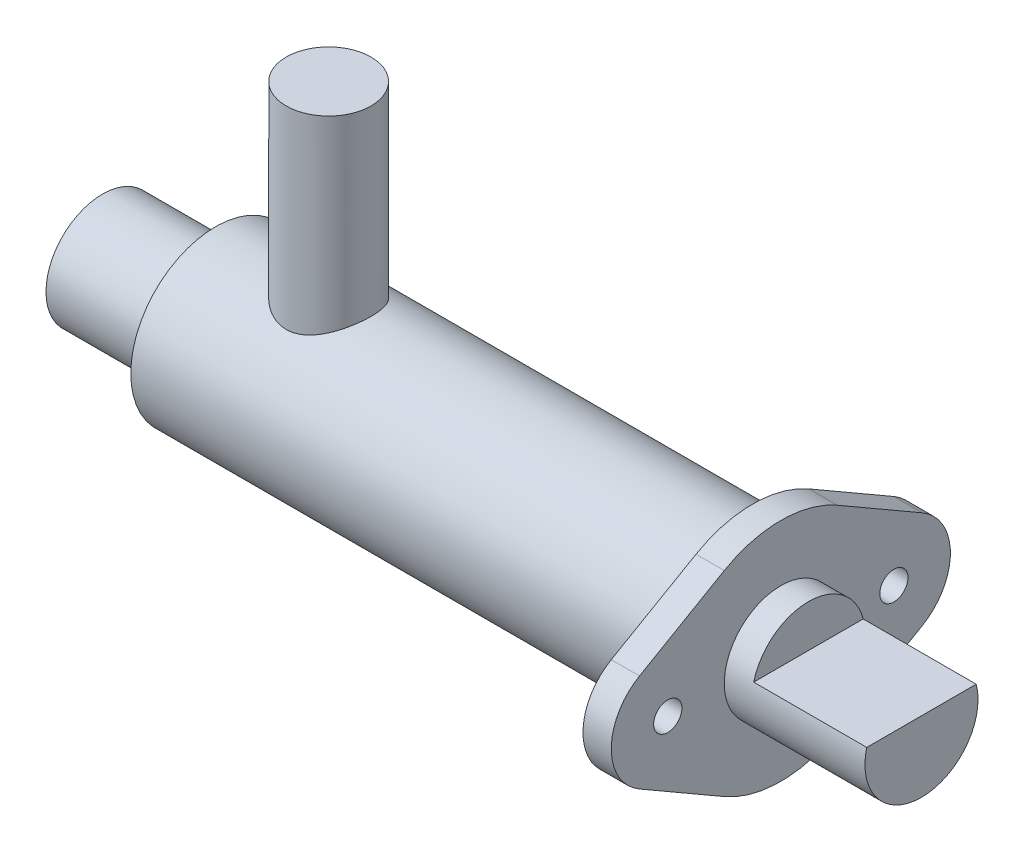
ISO-10303-21;
HEADER;
FILE_DESCRIPTION(('STEP AP214'),'2;1');
FILE_NAME('part.step','',(''),(''),'','','');
FILE_SCHEMA(('AUTOMOTIVE_DESIGN { 1 0 10303 214 1 1 1 1 }'));
ENDSEC;
DATA;
#1=APPLICATION_CONTEXT('core data for automotive mechanical design processes');
#2=APPLICATION_PROTOCOL_DEFINITION('international standard','automotive_design',2000,#1);
#3=PRODUCT_CONTEXT('',#1,'mechanical');
#4=PRODUCT('Part','Part','',(#3));
#5=PRODUCT_RELATED_PRODUCT_CATEGORY('part','',(#4));
#6=PRODUCT_DEFINITION_FORMATION('','',#4);
#7=PRODUCT_DEFINITION_CONTEXT('part definition',#1,'design');
#8=PRODUCT_DEFINITION('design','',#6,#7);
#9=PRODUCT_DEFINITION_SHAPE('','',#8);
#10=(LENGTH_UNIT() NAMED_UNIT(*) SI_UNIT(.MILLI.,.METRE.));
#11=(NAMED_UNIT(*) PLANE_ANGLE_UNIT() SI_UNIT($,.RADIAN.));
#12=(NAMED_UNIT(*) SI_UNIT($,.STERADIAN.) SOLID_ANGLE_UNIT());
#13=UNCERTAINTY_MEASURE_WITH_UNIT(LENGTH_MEASURE(1.E-05),#10,'distance_accuracy_value','');
#14=(GEOMETRIC_REPRESENTATION_CONTEXT(3) GLOBAL_UNCERTAINTY_ASSIGNED_CONTEXT((#13)) GLOBAL_UNIT_ASSIGNED_CONTEXT((#10,
#11,#12)) REPRESENTATION_CONTEXT('',''));
#15=CARTESIAN_POINT('',(0.,0.,0.));
#16=DIRECTION('',(0.,0.,1.));
#17=DIRECTION('',(1.,0.,0.));
#18=AXIS2_PLACEMENT_3D('',#15,#16,#17);
#19=CARTESIAN_POINT('',(-47.625,0.,0.));
#20=DIRECTION('',(-1.,0.,0.));
#21=DIRECTION('',(0.,0.,1.));
#22=AXIS2_PLACEMENT_3D('',#19,#20,#21);
#23=CYLINDRICAL_SURFACE('',#22,9.525);
#24=CARTESIAN_POINT('',(-34.925,0.,0.));
#25=DIRECTION('',(-1.,0.,0.));
#26=DIRECTION('',(0.,0.,1.));
#27=AXIS2_PLACEMENT_3D('',#24,#25,#26);
#28=CIRCLE('',#27,9.525);
#29=CARTESIAN_POINT('',(-34.925,0.,9.525));
#30=VERTEX_POINT('',#29);
#31=EDGE_CURVE('E54',#30,#30,#28,.T.);
#32=ORIENTED_EDGE('',*,*,#31,.F.);
#33=EDGE_LOOP('',(#32));
#34=FACE_BOUND('',#33,.T.);
#35=CARTESIAN_POINT('',(25.4,0.,0.));
#36=DIRECTION('',(-1.,0.,0.));
#37=DIRECTION('',(0.,0.,1.));
#38=AXIS2_PLACEMENT_3D('',#35,#36,#37);
#39=CIRCLE('',#38,9.525);
#40=CARTESIAN_POINT('',(25.4,0.,9.525));
#41=VERTEX_POINT('',#40);
#42=EDGE_CURVE('E11',#41,#41,#39,.F.);
#43=ORIENTED_EDGE('',*,*,#42,.F.);
#44=EDGE_LOOP('',(#43));
#45=FACE_BOUND('',#44,.T.);
#46=CARTESIAN_POINT('',(-22.225,8.24889197104678,-4.7625));
#47=CARTESIAN_POINT('',(-22.1008590969017,8.24889272394164,-4.76249940729929));
#48=CARTESIAN_POINT('',(-21.9767071497996,8.25170408952825,-4.75763943059537));
#49=CARTESIAN_POINT('',(-21.7293616546142,8.26284430339843,-4.73826449608749));
#50=CARTESIAN_POINT('',(-21.6061685797408,8.27117572034719,-4.72374504339219));
#51=CARTESIAN_POINT('',(-21.3615458554706,8.29306424044599,-4.68521103701737));
#52=CARTESIAN_POINT('',(-21.2401192826448,8.30662953786715,-4.66118159277235));
#53=CARTESIAN_POINT('',(-21.0000683650749,8.33849424083486,-4.60393332228032));
#54=CARTESIAN_POINT('',(-20.8814452632816,8.35679570478326,-4.57071050003109));
#55=CARTESIAN_POINT('',(-20.5323015748237,8.41767757563678,-4.45820926505093));
#56=CARTESIAN_POINT('',(-20.3069199645013,8.46639036631087,-4.36584227707579));
#57=CARTESIAN_POINT('',(-19.8750282380635,8.57453511094491,-4.14940045989174));
#58=CARTESIAN_POINT('',(-19.6685191436925,8.63396764474657,-4.02532391532954));
#59=CARTESIAN_POINT('',(-19.2612861365955,8.76284791263908,-3.73698658313422));
#60=CARTESIAN_POINT('',(-19.0624441753375,8.83271738343829,-3.57025552600526));
#61=CARTESIAN_POINT('',(-18.6940167283998,8.97122433178734,-3.20633353614955));
#62=CARTESIAN_POINT('',(-18.5244458361945,9.03986117960625,-3.00912750204738));
#63=CARTESIAN_POINT('',(-18.2900068266763,9.13908932048077,-2.68636629044315));
#64=CARTESIAN_POINT('',(-18.2131527226233,9.17251360649317,-2.57020878007104));
#65=CARTESIAN_POINT('',(-18.069596196185,9.23620349246427,-2.33097830003148));
#66=CARTESIAN_POINT('',(-18.0028897332615,9.26647034811662,-2.20790810968896));
#67=CARTESIAN_POINT('',(-17.8802891396933,9.32297018211123,-1.95564815668434));
#68=CARTESIAN_POINT('',(-17.8243922237504,9.34920419923749,-1.82645998115371));
#69=CARTESIAN_POINT('',(-17.7240269574238,9.39686248352726,-1.56285911383248));
#70=CARTESIAN_POINT('',(-17.6795573931323,9.41828726153724,-1.42844697872177));
#71=CARTESIAN_POINT('',(-17.6053602243203,9.45432792849539,-1.16519740858918));
#72=CARTESIAN_POINT('',(-17.5748091705922,9.46931966688269,-1.03664325296874));
#73=CARTESIAN_POINT('',(-17.5244444767481,9.49415396935545,-0.776963002287312));
#74=CARTESIAN_POINT('',(-17.5046297912202,9.50399703476961,-0.645837158923182));
#75=CARTESIAN_POINT('',(-17.4760065343755,9.51824582475992,-0.382159245593983));
#76=CARTESIAN_POINT('',(-17.4671926503398,9.52265417396123,-0.249607895282792));
#77=CARTESIAN_POINT('',(-17.4606765974385,9.52591136422363,0.0158324946519543));
#78=CARTESIAN_POINT('',(-17.4629737487424,9.52476054542327,0.148721513117988));
#79=CARTESIAN_POINT('',(-17.4779596490716,9.51727773119995,0.402105764472281));
#80=CARTESIAN_POINT('',(-17.489724135882,9.51140660802771,0.522670621045648));
#81=CARTESIAN_POINT('',(-17.52234802378,9.49520689673846,0.762297504084284));
#82=CARTESIAN_POINT('',(-17.5432102971939,9.48487690088979,0.881359043701557));
#83=CARTESIAN_POINT('',(-17.5937985131175,9.4600084221586,1.1170953858544));
#84=CARTESIAN_POINT('',(-17.6235214848597,9.44547134984976,1.23377097435057));
#85=CARTESIAN_POINT('',(-17.6915263412339,9.41253030003386,1.46405663273085));
#86=CARTESIAN_POINT('',(-17.7298115145343,9.39412483687505,1.57766550587512));
#87=CARTESIAN_POINT('',(-17.8581442489874,9.33315909327112,1.91586173980296));
#88=CARTESIAN_POINT('',(-17.961008933467,9.28518547508369,2.13476891421778));
#89=CARTESIAN_POINT('',(-18.1971915319788,9.1791264414455,2.55262754610699));
#90=CARTESIAN_POINT('',(-18.330520348699,9.12103740760329,2.75157182236461));
#91=CARTESIAN_POINT('',(-18.6383264592419,8.99371794927081,3.14406030579801));
#92=CARTESIAN_POINT('',(-18.815502061308,8.92395340854905,3.33531640619751));
#93=CARTESIAN_POINT('',(-19.1988972053729,8.78462733363278,3.68669670801986));
#94=CARTESIAN_POINT('',(-19.4051388849274,8.71506599580986,3.84679695689711));
#95=CARTESIAN_POINT('',(-19.7401135248814,8.61432292972857,4.06522723980458));
#96=CARTESIAN_POINT('',(-19.859994477451,8.58040455630013,4.13613898270465));
#97=CARTESIAN_POINT('',(-20.1061806073308,8.51583950077812,4.2674875647323));
#98=CARTESIAN_POINT('',(-20.2324828617701,8.48519134947439,4.32792911546943));
#99=CARTESIAN_POINT('',(-20.4907225092646,8.42829064611799,4.43772127646409));
#100=CARTESIAN_POINT('',(-20.6226579040663,8.40203655134898,4.48707578138171));
#101=CARTESIAN_POINT('',(-20.8912053825654,8.35498507502528,4.57409004971375));
#102=CARTESIAN_POINT('',(-21.0278145200478,8.33418432493701,4.61175703516624));
#103=CARTESIAN_POINT('',(-21.2937251064497,8.30033105740274,4.67239107161606));
#104=CARTESIAN_POINT('',(-21.4227546942039,8.28679731609861,4.69628224178035));
#105=CARTESIAN_POINT('',(-21.6827672095106,8.26567972970449,4.73335209140224));
#106=CARTESIAN_POINT('',(-21.8137490850902,8.25809279049908,4.74653634178892));
#107=CARTESIAN_POINT('',(-22.0765199908754,8.24918359612277,4.76200330923097));
#108=CARTESIAN_POINT('',(-22.208308702214,8.24785900822165,4.76429008560556));
#109=CARTESIAN_POINT('',(-22.4715269161829,8.25152581127932,4.75793657566527));
#110=CARTESIAN_POINT('',(-22.6029564424594,8.25651677591305,4.74929702692111));
#111=CARTESIAN_POINT('',(-22.8499235335336,8.27171481492305,4.72277057816311));
#112=CARTESIAN_POINT('',(-22.9656220514088,8.28128924981291,4.7060027358946));
#113=CARTESIAN_POINT('',(-23.19504203488,8.30494741203159,4.66412284465984));
#114=CARTESIAN_POINT('',(-23.3087628674355,8.3190325561764,4.63900817385685));
#115=CARTESIAN_POINT('',(-23.64585381483,8.36742301080679,4.55152408813005));
#116=CARTESIAN_POINT('',(-23.8653138630672,8.40787423037301,4.47699683650417));
#117=CARTESIAN_POINT('',(-24.2986813068859,8.50278882622772,4.29409140569222));
#118=CARTESIAN_POINT('',(-24.5118607665569,8.55781440671015,4.18430528181162));
#119=CARTESIAN_POINT('',(-24.9180392026927,8.67518529385013,3.93519108835804));
#120=CARTESIAN_POINT('',(-25.1110277360791,8.73753435328996,3.79584784304953));
#121=CARTESIAN_POINT('',(-25.4967340619561,8.87196405469708,3.4710976585416));
#122=CARTESIAN_POINT('',(-25.6863511708933,8.94428069402612,3.28209830684247));
#123=CARTESIAN_POINT('',(-26.0322210496743,9.08372577215842,2.87366994707528));
#124=CARTESIAN_POINT('',(-26.1884625493693,9.15085245356966,2.65423070130584));
#125=CARTESIAN_POINT('',(-26.3960065237566,9.24324496229829,2.30289806207733));
#126=CARTESIAN_POINT('',(-26.4613981500596,9.27299632526353,2.18030840919905));
#127=CARTESIAN_POINT('',(-26.581503084002,9.32847745043035,1.92915304044621));
#128=CARTESIAN_POINT('',(-26.6362211212174,9.35420899284426,1.80059000285164));
#129=CARTESIAN_POINT('',(-26.7343425578048,9.40087915370989,1.53844708260747));
#130=CARTESIAN_POINT('',(-26.7777513541146,9.42182005774161,1.40486962786039));
#131=CARTESIAN_POINT('',(-26.8527298949067,9.45827821966215,1.13371049467199));
#132=CARTESIAN_POINT('',(-26.8843010432804,9.47379612067972,0.99612929314372));
#133=CARTESIAN_POINT('',(-26.9328217695269,9.49775785076805,0.730949873202788));
#134=CARTESIAN_POINT('',(-26.9508474215171,9.50672024509145,0.603594424498006));
#135=CARTESIAN_POINT('',(-26.9765400141555,9.51951815365963,0.347590307680262));
#136=CARTESIAN_POINT('',(-26.9842077551466,9.52335406402124,0.218941740258937));
#137=CARTESIAN_POINT('',(-26.9890841762651,9.52579195912168,-0.0385649394422895));
#138=CARTESIAN_POINT('',(-26.9862959003281,9.52439546710759,-0.167422979823387));
#139=CARTESIAN_POINT('',(-26.9703049482656,9.51641162435963,-0.424324690613391));
#140=CARTESIAN_POINT('',(-26.9571025588401,9.50982441652587,-0.552368383343417));
#141=CARTESIAN_POINT('',(-26.921665410355,9.4922422956568,-0.798199011861471));
#142=CARTESIAN_POINT('',(-26.9000863753989,9.48156800281864,-0.916103849257608));
#143=CARTESIAN_POINT('',(-26.8482319693504,9.45610870385304,-1.14954398448085));
#144=CARTESIAN_POINT('',(-26.8179538290378,9.44132238877767,-1.26507851519124));
#145=CARTESIAN_POINT('',(-26.7145056473315,9.39128133846021,-1.60695881055025));
#146=CARTESIAN_POINT('',(-26.6286914163555,9.35032881269076,-1.82878870604021));
#147=CARTESIAN_POINT('',(-26.4220557838121,9.25477034679553,-2.26424000888416));
#148=CARTESIAN_POINT('',(-26.2998940929096,9.1996553597058,-2.47710454166772));
#149=CARTESIAN_POINT('',(-26.0256747343117,9.08152237528229,-2.88023067814637));
#150=CARTESIAN_POINT('',(-25.873603335527,9.01850075296339,-3.07048183578565));
#151=CARTESIAN_POINT('',(-25.5263886495207,8.88342722741462,-3.44287591291447));
#152=CARTESIAN_POINT('',(-25.3284649955475,8.81110081200555,-3.62232759996091));
#153=CARTESIAN_POINT('',(-24.9040995620519,8.67074486013806,-3.94652779549558));
#154=CARTESIAN_POINT('',(-24.6776328202441,8.60271916402209,-4.09124560184487));
#155=CARTESIAN_POINT('',(-24.3164807674514,8.50907579729457,-4.28094082941504));
#156=CARTESIAN_POINT('',(-24.190363422381,8.47885685291069,-4.34031088280345));
#157=CARTESIAN_POINT('',(-23.932589170762,8.42284293524443,-4.44803619028847));
#158=CARTESIAN_POINT('',(-23.8009351588988,8.39704568515324,-4.49639711741462));
#159=CARTESIAN_POINT('',(-23.5333464997363,8.35096779630417,-4.58140792637852));
#160=CARTESIAN_POINT('',(-23.3974238745861,8.33067298601897,-4.61808793582061));
#161=CARTESIAN_POINT('',(-23.1221672323918,8.29641582497272,-4.67935352294883));
#162=CARTESIAN_POINT('',(-22.982835672277,8.28244904731642,-4.70394755663098));
#163=CARTESIAN_POINT('',(-22.7403045126998,8.26434282908568,-4.73566148400959));
#164=CARTESIAN_POINT('',(-22.637599934044,8.25856285278519,-4.74571628165859));
#165=CARTESIAN_POINT('',(-22.431599478867,8.25083698225999,-4.7591360100298));
#166=CARTESIAN_POINT('',(-22.3283035632528,8.24889134452708,-4.76250049321452));
#167=CARTESIAN_POINT('',(-22.225,8.24889197104678,-4.7625));
#168=B_SPLINE_CURVE_WITH_KNOTS('',3,(#46,#47,#48,#49,#50,#51,#52,#53,#54,#55,#56,#57,#58,#59,
#60,#61,#62,#63,#64,#65,#66,#67,#68,#69,#70,#71,#72,#73,#74,#75,#76,#77,#78,#79,#80,#81,#82,#83,
#84,#85,#86,#87,#88,#89,#90,#91,#92,#93,#94,#95,#96,#97,#98,#99,#100,#101,#102,#103,#104,#105,
#106,#107,#108,#109,#110,#111,#112,#113,#114,#115,#116,#117,#118,#119,#120,#121,#122,#123,#124,
#125,#126,#127,#128,#129,#130,#131,#132,#133,#134,#135,#136,#137,#138,#139,#140,#141,#142,#143,
#144,#145,#146,#147,#148,#149,#150,#151,#152,#153,#154,#155,#156,#157,#158,#159,#160,#161,#162,
#163,#164,#165,#166,#167),.UNSPECIFIED.,.T.,.F.,(4,2,2,2,2,2,2,2,2,2,2,2,2,2,2,2,2,2,2,2,2,2,2,
2,2,2,2,2,2,2,2,2,2,2,2,2,2,2,2,2,2,2,2,2,2,2,2,2,2,2,2,2,2,2,2,2,2,2,2,2,4),(0.,
0.372315471290056,0.74480431525927,1.11787871748515,1.49111553598561,2.23280682202776,
2.97453823893684,3.77744614727716,4.58075320689749,5.00998800301853,5.43905143864814,
5.8680041696826,6.29691131496348,6.69531812541003,7.09368613557448,7.4918616836556,
7.89001286961349,8.25342137640537,8.61694470062129,8.98034628149852,9.3438876822603,
10.0802760151874,10.8169283051732,11.6232144167404,12.4301179713144,12.8597106878863,
13.289109581744,13.7183573995584,14.1473394427285,14.5425345752374,14.9375239513557,
15.3323661820562,15.7271817607473,16.0786628916725,16.4302545314545,17.1329551681528,
17.8682015372252,18.603826327115,19.432180208912,20.2608133654722,20.6865967300835,
21.1121909950173,21.5375817864788,21.9629221125511,22.3492223853007,22.735492807399,
23.1216507879208,23.5077981379075,23.8683853074205,24.2290873914766,24.9498683654814,
25.7014774099866,26.4534323155185,27.2802219250812,28.1077396849722,28.5351353836894,
28.9623103432981,29.388374431565,29.8141399966485,30.1239407256422,30.4337621775449),.UNSPECIFIED.);
#169=CARTESIAN_POINT('',(-22.225,8.24889197104678,-4.7625));
#170=VERTEX_POINT('',#169);
#171=EDGE_CURVE('E45',#170,#170,#168,.T.);
#172=ORIENTED_EDGE('',*,*,#171,.T.);
#173=EDGE_LOOP('',(#172));
#174=FACE_BOUND('',#173,.T.);
#175=ADVANCED_FACE('F41',(#34,#45,#174),#23,.T.);
#176=CARTESIAN_POINT('',(-34.925,-6.35,0.));
#177=DIRECTION('',(-1.,0.,0.));
#178=DIRECTION('',(0.,0.,1.));
#179=AXIS2_PLACEMENT_3D('',#176,#177,#178);
#180=PLANE('',#179);
#181=ORIENTED_EDGE('',*,*,#31,.T.);
#182=EDGE_LOOP('',(#181));
#183=FACE_BOUND('',#182,.T.);
#184=CARTESIAN_POINT('',(-34.925,0.,0.));
#185=DIRECTION('',(-1.,0.,0.));
#186=DIRECTION('',(0.,0.,1.));
#187=AXIS2_PLACEMENT_3D('',#184,#185,#186);
#188=CIRCLE('',#187,6.35);
#189=CARTESIAN_POINT('',(-34.925,0.,6.35));
#190=VERTEX_POINT('',#189);
#191=EDGE_CURVE('E201',#190,#190,#188,.T.);
#192=ORIENTED_EDGE('',*,*,#191,.F.);
#193=EDGE_LOOP('',(#192));
#194=FACE_BOUND('',#193,.T.);
#195=ADVANCED_FACE('F207',(#183,#194),#180,.T.);
#196=CARTESIAN_POINT('',(-47.625,0.,0.));
#197=DIRECTION('',(-1.,0.,0.));
#198=DIRECTION('',(0.,0.,1.));
#199=AXIS2_PLACEMENT_3D('',#196,#197,#198);
#200=CYLINDRICAL_SURFACE('',#199,6.35);
#201=ORIENTED_EDGE('',*,*,#191,.T.);
#202=EDGE_LOOP('',(#201));
#203=FACE_BOUND('',#202,.T.);
#204=CARTESIAN_POINT('',(-47.625,0.,0.));
#205=DIRECTION('',(-1.,0.,0.));
#206=DIRECTION('',(0.,0.,1.));
#207=AXIS2_PLACEMENT_3D('',#204,#205,#206);
#208=CIRCLE('',#207,6.35);
#209=CARTESIAN_POINT('',(-47.625,0.,6.35));
#210=VERTEX_POINT('',#209);
#211=EDGE_CURVE('E198',#210,#210,#208,.T.);
#212=ORIENTED_EDGE('',*,*,#211,.F.);
#213=EDGE_LOOP('',(#212));
#214=FACE_BOUND('',#213,.T.);
#215=ADVANCED_FACE('F299',(#203,#214),#200,.T.);
#216=CARTESIAN_POINT('',(-47.625,0.,0.));
#217=DIRECTION('',(-1.,0.,0.));
#218=DIRECTION('',(0.,0.,1.));
#219=AXIS2_PLACEMENT_3D('',#216,#217,#218);
#220=PLANE('',#219);
#221=ORIENTED_EDGE('',*,*,#211,.T.);
#222=EDGE_LOOP('',(#221));
#223=FACE_BOUND('',#222,.T.);
#224=ADVANCED_FACE('F296',(#223),#220,.T.);
#225=CARTESIAN_POINT('',(25.4,0.,12.7));
#226=DIRECTION('',(1.,0.,0.));
#227=DIRECTION('',(0.,0.,-1.));
#228=AXIS2_PLACEMENT_3D('',#225,#226,#227);
#229=CYLINDRICAL_SURFACE('',#228,6.34999999999997);
#230=CARTESIAN_POINT('',(28.575,0.,12.7));
#231=DIRECTION('',(-1.,0.,0.));
#232=DIRECTION('',(0.,0.,1.));
#233=AXIS2_PLACEMENT_3D('',#230,#231,#232);
#234=CIRCLE('',#233,6.34999999999997);
#235=CARTESIAN_POINT('',(28.575,-5.4992613140312,15.875));
#236=VERTEX_POINT('',#235);
#237=CARTESIAN_POINT('',(28.575,5.49926131403114,15.875));
#238=VERTEX_POINT('',#237);
#239=EDGE_CURVE('E162',#236,#238,#234,.T.);
#240=ORIENTED_EDGE('',*,*,#239,.T.);
#241=DIRECTION('',(1.,0.,0.));
#242=VECTOR('',#241,1.);
#243=CARTESIAN_POINT('',(25.4,5.49926131403114,15.875));
#244=LINE('',#243,#242);
#245=CARTESIAN_POINT('',(25.4,5.49926131403114,15.875));
#246=VERTEX_POINT('',#245);
#247=EDGE_CURVE('E196',#246,#238,#244,.T.);
#248=ORIENTED_EDGE('',*,*,#247,.F.);
#249=CARTESIAN_POINT('',(25.4,0.,12.7));
#250=DIRECTION('',(-1.,0.,0.));
#251=DIRECTION('',(0.,0.,1.));
#252=AXIS2_PLACEMENT_3D('',#249,#250,#251);
#253=CIRCLE('',#252,6.34999999999997);
#254=CARTESIAN_POINT('',(25.4,-5.4992613140312,15.875));
#255=VERTEX_POINT('',#254);
#256=EDGE_CURVE('E186',#255,#246,#253,.T.);
#257=ORIENTED_EDGE('',*,*,#256,.F.);
#258=DIRECTION('',(1.,0.,0.));
#259=VECTOR('',#258,1.);
#260=CARTESIAN_POINT('',(25.4,-5.4992613140312,15.875));
#261=LINE('',#260,#259);
#262=EDGE_CURVE('E70',#255,#236,#261,.T.);
#263=ORIENTED_EDGE('',*,*,#262,.T.);
#264=EDGE_LOOP('',(#240,#248,#257,#263));
#265=FACE_BOUND('',#264,.T.);
#266=ADVANCED_FACE('F273',(#265),#229,.T.);
#267=CARTESIAN_POINT('',(25.4,5.49926131403114,15.875));
#268=DIRECTION('',(0.,-0.866025403784437,-0.500000000000003));
#269=DIRECTION('',(0.,0.500000000000003,-0.866025403784437));
#270=AXIS2_PLACEMENT_3D('',#267,#268,#269);
#271=PLANE('',#270);
#272=DIRECTION('',(0.,0.500000000000003,-0.866025403784437));
#273=VECTOR('',#272,1.);
#274=CARTESIAN_POINT('',(28.575,5.49926131403114,15.875));
#275=LINE('',#274,#273);
#276=CARTESIAN_POINT('',(28.575,10.9985226280624,6.35000000000004));
#277=VERTEX_POINT('',#276);
#278=EDGE_CURVE('E164',#238,#277,#275,.T.);
#279=ORIENTED_EDGE('',*,*,#278,.T.);
#280=DIRECTION('',(1.,0.,0.));
#281=VECTOR('',#280,1.);
#282=CARTESIAN_POINT('',(25.4,10.9985226280624,6.35000000000004));
#283=LINE('',#282,#281);
#284=CARTESIAN_POINT('',(25.4,10.9985226280624,6.35000000000004));
#285=VERTEX_POINT('',#284);
#286=EDGE_CURVE('E194',#285,#277,#283,.T.);
#287=ORIENTED_EDGE('',*,*,#286,.F.);
#288=DIRECTION('',(0.,0.500000000000003,-0.866025403784437));
#289=VECTOR('',#288,1.);
#290=CARTESIAN_POINT('',(25.4,5.49926131403114,15.875));
#291=LINE('',#290,#289);
#292=EDGE_CURVE('E110',#246,#285,#291,.T.);
#293=ORIENTED_EDGE('',*,*,#292,.F.);
#294=ORIENTED_EDGE('',*,*,#247,.T.);
#295=EDGE_LOOP('',(#279,#287,#293,#294));
#296=FACE_BOUND('',#295,.T.);
#297=ADVANCED_FACE('F274',(#296),#271,.F.);
#298=CARTESIAN_POINT('',(25.4,0.,0.));
#299=DIRECTION('',(1.,0.,0.));
#300=DIRECTION('',(0.,0.,-1.));
#301=AXIS2_PLACEMENT_3D('',#298,#299,#300);
#302=CYLINDRICAL_SURFACE('',#301,12.7000000000001);
#303=CARTESIAN_POINT('',(28.575,0.,0.));
#304=DIRECTION('',(1.,0.,0.));
#305=DIRECTION('',(0.,0.,-1.));
#306=AXIS2_PLACEMENT_3D('',#303,#304,#305);
#307=CIRCLE('',#306,12.7000000000001);
#308=CARTESIAN_POINT('',(28.575,10.9985226280623,-6.35000000000016));
#309=VERTEX_POINT('',#308);
#310=EDGE_CURVE('E169',#309,#277,#307,.T.);
#311=ORIENTED_EDGE('',*,*,#310,.F.);
#312=DIRECTION('',(1.,0.,0.));
#313=VECTOR('',#312,1.);
#314=CARTESIAN_POINT('',(25.4,10.9985226280623,-6.35000000000016));
#315=LINE('',#314,#313);
#316=CARTESIAN_POINT('',(25.4,10.9985226280623,-6.35000000000016));
#317=VERTEX_POINT('',#316);
#318=EDGE_CURVE('E192',#317,#309,#315,.T.);
#319=ORIENTED_EDGE('',*,*,#318,.F.);
#320=CARTESIAN_POINT('',(25.4,0.,0.));
#321=DIRECTION('',(1.,0.,0.));
#322=DIRECTION('',(0.,0.,-1.));
#323=AXIS2_PLACEMENT_3D('',#320,#321,#322);
#324=CIRCLE('',#323,12.7000000000001);
#325=EDGE_CURVE('E259',#317,#285,#324,.T.);
#326=ORIENTED_EDGE('',*,*,#325,.T.);
#327=ORIENTED_EDGE('',*,*,#286,.T.);
#328=EDGE_LOOP('',(#311,#319,#326,#327));
#329=FACE_BOUND('',#328,.T.);
#330=ADVANCED_FACE('F277',(#329),#302,.T.);
#331=CARTESIAN_POINT('',(25.4,5.4992613140312,-15.8750000000002));
#332=DIRECTION('',(0.,0.866025403784439,-0.5));
#333=DIRECTION('',(0.,0.5,0.866025403784439));
#334=AXIS2_PLACEMENT_3D('',#331,#332,#333);
#335=PLANE('',#334);
#336=DIRECTION('',(0.,0.5,0.866025403784439));
#337=VECTOR('',#336,1.);
#338=CARTESIAN_POINT('',(28.575,5.4992613140312,-15.8750000000002));
#339=LINE('',#338,#337);
#340=CARTESIAN_POINT('',(28.575,5.4992613140312,-15.8750000000002));
#341=VERTEX_POINT('',#340);
#342=EDGE_CURVE('E173',#341,#309,#339,.T.);
#343=ORIENTED_EDGE('',*,*,#342,.F.);
#344=DIRECTION('',(1.,0.,0.));
#345=VECTOR('',#344,1.);
#346=CARTESIAN_POINT('',(25.4,5.4992613140312,-15.8750000000002));
#347=LINE('',#346,#345);
#348=CARTESIAN_POINT('',(25.4,5.4992613140312,-15.8750000000002));
#349=VERTEX_POINT('',#348);
#350=EDGE_CURVE('E190',#349,#341,#347,.T.);
#351=ORIENTED_EDGE('',*,*,#350,.F.);
#352=DIRECTION('',(0.,0.5,0.866025403784439));
#353=VECTOR('',#352,1.);
#354=CARTESIAN_POINT('',(25.4,5.4992613140312,-15.8750000000002));
#355=LINE('',#354,#353);
#356=EDGE_CURVE('E263',#349,#317,#355,.T.);
#357=ORIENTED_EDGE('',*,*,#356,.T.);
#358=ORIENTED_EDGE('',*,*,#318,.T.);
#359=EDGE_LOOP('',(#343,#351,#357,#358));
#360=FACE_BOUND('',#359,.T.);
#361=ADVANCED_FACE('F279',(#360),#335,.T.);
#362=CARTESIAN_POINT('',(25.4,0.,-12.7000000000002));
#363=DIRECTION('',(1.,0.,0.));
#364=DIRECTION('',(0.,0.,-1.));
#365=AXIS2_PLACEMENT_3D('',#362,#363,#364);
#366=CYLINDRICAL_SURFACE('',#365,6.34999999999999);
#367=CARTESIAN_POINT('',(28.575,0.,-12.7000000000002));
#368=DIRECTION('',(1.,0.,0.));
#369=DIRECTION('',(0.,0.,-1.));
#370=AXIS2_PLACEMENT_3D('',#367,#368,#369);
#371=CIRCLE('',#370,6.34999999999999);
#372=CARTESIAN_POINT('',(28.575,-5.49926131403115,-15.8750000000002));
#373=VERTEX_POINT('',#372);
#374=EDGE_CURVE('E176',#373,#341,#371,.T.);
#375=ORIENTED_EDGE('',*,*,#374,.F.);
#376=DIRECTION('',(1.,0.,0.));
#377=VECTOR('',#376,1.);
#378=CARTESIAN_POINT('',(25.4,-5.49926131403115,-15.8750000000002));
#379=LINE('',#378,#377);
#380=CARTESIAN_POINT('',(25.4,-5.49926131403115,-15.8750000000002));
#381=VERTEX_POINT('',#380);
#382=EDGE_CURVE('E149',#381,#373,#379,.T.);
#383=ORIENTED_EDGE('',*,*,#382,.F.);
#384=CARTESIAN_POINT('',(25.4,0.,-12.7000000000002));
#385=DIRECTION('',(1.,0.,0.));
#386=DIRECTION('',(0.,0.,-1.));
#387=AXIS2_PLACEMENT_3D('',#384,#385,#386);
#388=CIRCLE('',#387,6.34999999999999);
#389=EDGE_CURVE('E138',#381,#349,#388,.T.);
#390=ORIENTED_EDGE('',*,*,#389,.T.);
#391=ORIENTED_EDGE('',*,*,#350,.T.);
#392=EDGE_LOOP('',(#375,#383,#390,#391));
#393=FACE_BOUND('',#392,.T.);
#394=ADVANCED_FACE('F267',(#393),#366,.T.);
#395=CARTESIAN_POINT('',(25.4,-5.49926131403115,-15.8750000000002));
#396=DIRECTION('',(0.,0.866025403784437,0.500000000000002));
#397=DIRECTION('',(0.,-0.500000000000002,0.866025403784437));
#398=AXIS2_PLACEMENT_3D('',#395,#396,#397);
#399=PLANE('',#398);
#400=DIRECTION('',(0.,-0.500000000000002,0.866025403784437));
#401=VECTOR('',#400,1.);
#402=CARTESIAN_POINT('',(28.575,-5.49926131403115,-15.8750000000002));
#403=LINE('',#402,#401);
#404=CARTESIAN_POINT('',(28.575,-10.9985226280623,-6.35000000000022));
#405=VERTEX_POINT('',#404);
#406=EDGE_CURVE('E145',#373,#405,#403,.T.);
#407=ORIENTED_EDGE('',*,*,#406,.T.);
#408=DIRECTION('',(1.,0.,0.));
#409=VECTOR('',#408,1.);
#410=CARTESIAN_POINT('',(25.4,-10.9985226280623,-6.35000000000022));
#411=LINE('',#410,#409);
#412=CARTESIAN_POINT('',(25.4,-10.9985226280623,-6.35000000000022));
#413=VERTEX_POINT('',#412);
#414=EDGE_CURVE('E142',#413,#405,#411,.T.);
#415=ORIENTED_EDGE('',*,*,#414,.F.);
#416=DIRECTION('',(0.,-0.500000000000002,0.866025403784437));
#417=VECTOR('',#416,1.);
#418=CARTESIAN_POINT('',(25.4,-5.49926131403115,-15.8750000000002));
#419=LINE('',#418,#417);
#420=EDGE_CURVE('E130',#381,#413,#419,.T.);
#421=ORIENTED_EDGE('',*,*,#420,.F.);
#422=ORIENTED_EDGE('',*,*,#382,.T.);
#423=EDGE_LOOP('',(#407,#415,#421,#422));
#424=FACE_BOUND('',#423,.T.);
#425=ADVANCED_FACE('F143',(#424),#399,.F.);
#426=CARTESIAN_POINT('',(25.4,0.,0.));
#427=DIRECTION('',(1.,0.,0.));
#428=DIRECTION('',(0.,0.,-1.));
#429=AXIS2_PLACEMENT_3D('',#426,#427,#428);
#430=CYLINDRICAL_SURFACE('',#429,12.7);
#431=CARTESIAN_POINT('',(28.575,0.,0.));
#432=DIRECTION('',(1.,0.,0.));
#433=DIRECTION('',(0.,0.,-1.));
#434=AXIS2_PLACEMENT_3D('',#431,#432,#433);
#435=CIRCLE('',#434,12.7);
#436=CARTESIAN_POINT('',(28.575,-10.9985226280624,6.35000000000003));
#437=VERTEX_POINT('',#436);
#438=EDGE_CURVE('E180',#437,#405,#435,.T.);
#439=ORIENTED_EDGE('',*,*,#438,.F.);
#440=DIRECTION('',(1.,0.,0.));
#441=VECTOR('',#440,1.);
#442=CARTESIAN_POINT('',(25.4,-10.9985226280624,6.35000000000003));
#443=LINE('',#442,#441);
#444=CARTESIAN_POINT('',(25.4,-10.9985226280624,6.35000000000003));
#445=VERTEX_POINT('',#444);
#446=EDGE_CURVE('E150',#445,#437,#443,.T.);
#447=ORIENTED_EDGE('',*,*,#446,.F.);
#448=CARTESIAN_POINT('',(25.4,0.,0.));
#449=DIRECTION('',(1.,0.,0.));
#450=DIRECTION('',(0.,0.,-1.));
#451=AXIS2_PLACEMENT_3D('',#448,#449,#450);
#452=CIRCLE('',#451,12.7);
#453=EDGE_CURVE('E135',#445,#413,#452,.T.);
#454=ORIENTED_EDGE('',*,*,#453,.T.);
#455=ORIENTED_EDGE('',*,*,#414,.T.);
#456=EDGE_LOOP('',(#439,#447,#454,#455));
#457=FACE_BOUND('',#456,.T.);
#458=ADVANCED_FACE('F152',(#457),#430,.T.);
#459=CARTESIAN_POINT('',(25.4,-5.4992613140312,15.875));
#460=DIRECTION('',(0.,-0.866025403784438,0.500000000000001));
#461=DIRECTION('',(0.,-0.500000000000001,-0.866025403784438));
#462=AXIS2_PLACEMENT_3D('',#459,#460,#461);
#463=PLANE('',#462);
#464=DIRECTION('',(0.,-0.500000000000001,-0.866025403784438));
#465=VECTOR('',#464,1.);
#466=CARTESIAN_POINT('',(28.575,-5.4992613140312,15.875));
#467=LINE('',#466,#465);
#468=EDGE_CURVE('E183',#236,#437,#467,.T.);
#469=ORIENTED_EDGE('',*,*,#468,.F.);
#470=ORIENTED_EDGE('',*,*,#262,.F.);
#471=DIRECTION('',(0.,-0.500000000000001,-0.866025403784438));
#472=VECTOR('',#471,1.);
#473=CARTESIAN_POINT('',(25.4,-5.4992613140312,15.875));
#474=LINE('',#473,#472);
#475=EDGE_CURVE('E154',#255,#445,#474,.T.);
#476=ORIENTED_EDGE('',*,*,#475,.T.);
#477=ORIENTED_EDGE('',*,*,#446,.T.);
#478=EDGE_LOOP('',(#469,#470,#476,#477));
#479=FACE_BOUND('',#478,.T.);
#480=ADVANCED_FACE('F270',(#479),#463,.T.);
#481=CARTESIAN_POINT('',(25.4,0.,12.7));
#482=DIRECTION('',(-1.,0.,0.));
#483=DIRECTION('',(0.,0.,1.));
#484=AXIS2_PLACEMENT_3D('',#481,#482,#483);
#485=PLANE('',#484);
#486=ORIENTED_EDGE('',*,*,#42,.T.);
#487=EDGE_LOOP('',(#486));
#488=FACE_BOUND('',#487,.T.);
#489=CARTESIAN_POINT('',(25.4,0.,-12.7000000000002));
#490=DIRECTION('',(1.,0.,0.));
#491=DIRECTION('',(0.,0.,-1.));
#492=AXIS2_PLACEMENT_3D('',#489,#490,#491);
#493=CIRCLE('',#492,1.5875);
#494=CARTESIAN_POINT('',(25.4,0.,-14.2875000000002));
#495=VERTEX_POINT('',#494);
#496=EDGE_CURVE('E242',#495,#495,#493,.T.);
#497=ORIENTED_EDGE('',*,*,#496,.T.);
#498=EDGE_LOOP('',(#497));
#499=FACE_BOUND('',#498,.T.);
#500=CARTESIAN_POINT('',(25.4,0.,12.7));
#501=DIRECTION('',(1.,0.,0.));
#502=DIRECTION('',(0.,0.,-1.));
#503=AXIS2_PLACEMENT_3D('',#500,#501,#502);
#504=CIRCLE('',#503,1.5875);
#505=CARTESIAN_POINT('',(25.4,0.,11.1125));
#506=VERTEX_POINT('',#505);
#507=EDGE_CURVE('E165',#506,#506,#504,.T.);
#508=ORIENTED_EDGE('',*,*,#507,.T.);
#509=EDGE_LOOP('',(#508));
#510=FACE_BOUND('',#509,.T.);
#511=ORIENTED_EDGE('',*,*,#256,.T.);
#512=ORIENTED_EDGE('',*,*,#292,.T.);
#513=ORIENTED_EDGE('',*,*,#325,.F.);
#514=ORIENTED_EDGE('',*,*,#356,.F.);
#515=ORIENTED_EDGE('',*,*,#389,.F.);
#516=ORIENTED_EDGE('',*,*,#420,.T.);
#517=ORIENTED_EDGE('',*,*,#453,.F.);
#518=ORIENTED_EDGE('',*,*,#475,.F.);
#519=EDGE_LOOP('',(#511,#512,#513,#514,#515,#516,#517,#518));
#520=FACE_BOUND('',#519,.T.);
#521=ADVANCED_FACE('F132',(#488,#499,#510,#520),#485,.T.);
#522=CARTESIAN_POINT('',(25.4,0.,12.7));
#523=DIRECTION('',(1.,0.,0.));
#524=DIRECTION('',(0.,0.,-1.));
#525=AXIS2_PLACEMENT_3D('',#522,#523,#524);
#526=CYLINDRICAL_SURFACE('',#525,1.5875);
#527=ORIENTED_EDGE('',*,*,#507,.F.);
#528=EDGE_LOOP('',(#527));
#529=FACE_BOUND('',#528,.T.);
#530=CARTESIAN_POINT('',(28.575,0.,12.7));
#531=DIRECTION('',(1.,0.,0.));
#532=DIRECTION('',(0.,0.,-1.));
#533=AXIS2_PLACEMENT_3D('',#530,#531,#532);
#534=CIRCLE('',#533,1.5875);
#535=CARTESIAN_POINT('',(28.575,0.,11.1125));
#536=VERTEX_POINT('',#535);
#537=EDGE_CURVE('E246',#536,#536,#534,.T.);
#538=ORIENTED_EDGE('',*,*,#537,.T.);
#539=EDGE_LOOP('',(#538));
#540=FACE_BOUND('',#539,.T.);
#541=ADVANCED_FACE('F378',(#529,#540),#526,.F.);
#542=CARTESIAN_POINT('',(25.4,0.,-12.7000000000002));
#543=DIRECTION('',(1.,0.,0.));
#544=DIRECTION('',(0.,0.,-1.));
#545=AXIS2_PLACEMENT_3D('',#542,#543,#544);
#546=CYLINDRICAL_SURFACE('',#545,1.5875);
#547=ORIENTED_EDGE('',*,*,#496,.F.);
#548=EDGE_LOOP('',(#547));
#549=FACE_BOUND('',#548,.T.);
#550=CARTESIAN_POINT('',(28.575,0.,-12.7000000000002));
#551=DIRECTION('',(1.,0.,0.));
#552=DIRECTION('',(0.,0.,-1.));
#553=AXIS2_PLACEMENT_3D('',#550,#551,#552);
#554=CIRCLE('',#553,1.5875);
#555=CARTESIAN_POINT('',(28.575,0.,-14.2875000000002));
#556=VERTEX_POINT('',#555);
#557=EDGE_CURVE('E241',#556,#556,#554,.T.);
#558=ORIENTED_EDGE('',*,*,#557,.T.);
#559=EDGE_LOOP('',(#558));
#560=FACE_BOUND('',#559,.T.);
#561=ADVANCED_FACE('F315',(#549,#560),#546,.F.);
#562=CARTESIAN_POINT('',(28.575,0.,0.));
#563=DIRECTION('',(-1.,0.,0.));
#564=DIRECTION('',(0.,0.,1.));
#565=AXIS2_PLACEMENT_3D('',#562,#563,#564);
#566=PLANE('',#565);
#567=CARTESIAN_POINT('',(28.575,0.,0.));
#568=DIRECTION('',(1.,0.,0.));
#569=DIRECTION('',(0.,0.,-1.));
#570=AXIS2_PLACEMENT_3D('',#567,#568,#569);
#571=CIRCLE('',#570,6.35);
#572=CARTESIAN_POINT('',(28.575,0.,-6.35));
#573=VERTEX_POINT('',#572);
#574=EDGE_CURVE('E238',#573,#573,#571,.T.);
#575=ORIENTED_EDGE('',*,*,#574,.F.);
#576=EDGE_LOOP('',(#575));
#577=FACE_BOUND('',#576,.T.);
#578=ORIENTED_EDGE('',*,*,#557,.F.);
#579=EDGE_LOOP('',(#578));
#580=FACE_BOUND('',#579,.T.);
#581=ORIENTED_EDGE('',*,*,#537,.F.);
#582=EDGE_LOOP('',(#581));
#583=FACE_BOUND('',#582,.T.);
#584=ORIENTED_EDGE('',*,*,#239,.F.);
#585=ORIENTED_EDGE('',*,*,#468,.T.);
#586=ORIENTED_EDGE('',*,*,#438,.T.);
#587=ORIENTED_EDGE('',*,*,#406,.F.);
#588=ORIENTED_EDGE('',*,*,#374,.T.);
#589=ORIENTED_EDGE('',*,*,#342,.T.);
#590=ORIENTED_EDGE('',*,*,#310,.T.);
#591=ORIENTED_EDGE('',*,*,#278,.F.);
#592=EDGE_LOOP('',(#584,#585,#586,#587,#588,#589,#590,#591));
#593=FACE_BOUND('',#592,.T.);
#594=ADVANCED_FACE('F43',(#577,#580,#583,#593),#566,.F.);
#595=CARTESIAN_POINT('',(44.3761161124671,0.,0.));
#596=DIRECTION('',(-1.,0.,0.));
#597=DIRECTION('',(0.,-1.,0.));
#598=AXIS2_PLACEMENT_3D('',#595,#596,#597);
#599=CYLINDRICAL_SURFACE('',#598,6.35);
#600=CARTESIAN_POINT('',(44.3761161124671,0.,0.));
#601=DIRECTION('',(1.,0.,0.));
#602=DIRECTION('',(0.,1.,0.));
#603=AXIS2_PLACEMENT_3D('',#600,#601,#602);
#604=CIRCLE('',#603,6.35);
#605=CARTESIAN_POINT('',(44.3761161124671,1.5875,6.14836106210428));
#606=VERTEX_POINT('',#605);
#607=CARTESIAN_POINT('',(44.3761161124671,1.5875,-6.14836106210428));
#608=VERTEX_POINT('',#607);
#609=EDGE_CURVE('E234',#606,#608,#604,.T.);
#610=ORIENTED_EDGE('',*,*,#609,.F.);
#611=DIRECTION('',(1.,0.,0.));
#612=VECTOR('',#611,1.);
#613=CARTESIAN_POINT('',(31.6761161124671,1.5875,6.14836106210428));
#614=LINE('',#613,#612);
#615=CARTESIAN_POINT('',(31.6761161124671,1.5875,6.14836106210428));
#616=VERTEX_POINT('',#615);
#617=EDGE_CURVE('E61',#616,#606,#614,.T.);
#618=ORIENTED_EDGE('',*,*,#617,.F.);
#619=CARTESIAN_POINT('',(31.6761161124671,0.,0.));
#620=DIRECTION('',(1.,0.,0.));
#621=DIRECTION('',(0.,1.,0.));
#622=AXIS2_PLACEMENT_3D('',#619,#620,#621);
#623=CIRCLE('',#622,6.35);
#624=CARTESIAN_POINT('',(31.6761161124671,1.5875,-6.14836106210428));
#625=VERTEX_POINT('',#624);
#626=EDGE_CURVE('E219',#625,#616,#623,.T.);
#627=ORIENTED_EDGE('',*,*,#626,.F.);
#628=DIRECTION('',(1.,0.,0.));
#629=VECTOR('',#628,1.);
#630=CARTESIAN_POINT('',(31.6761161124671,1.5875,-6.14836106210428));
#631=LINE('',#630,#629);
#632=EDGE_CURVE('E231',#625,#608,#631,.T.);
#633=ORIENTED_EDGE('',*,*,#632,.T.);
#634=EDGE_LOOP('',(#610,#618,#627,#633));
#635=FACE_BOUND('',#634,.T.);
#636=ORIENTED_EDGE('',*,*,#574,.T.);
#637=EDGE_LOOP('',(#636));
#638=FACE_BOUND('',#637,.T.);
#639=ADVANCED_FACE('F314',(#635,#638),#599,.T.);
#640=CARTESIAN_POINT('',(44.3761161124671,0.,0.));
#641=DIRECTION('',(1.,0.,0.));
#642=DIRECTION('',(0.,1.,0.));
#643=AXIS2_PLACEMENT_3D('',#640,#641,#642);
#644=PLANE('',#643);
#645=DIRECTION('',(0.,0.,-1.));
#646=VECTOR('',#645,1.);
#647=CARTESIAN_POINT('',(44.3761161124671,1.5875,6.14836106210428));
#648=LINE('',#647,#646);
#649=EDGE_CURVE('E217',#606,#608,#648,.T.);
#650=ORIENTED_EDGE('',*,*,#649,.F.);
#651=ORIENTED_EDGE('',*,*,#609,.T.);
#652=EDGE_LOOP('',(#650,#651));
#653=FACE_BOUND('',#652,.T.);
#654=ADVANCED_FACE('F404',(#653),#644,.T.);
#655=CARTESIAN_POINT('',(31.6761161124671,1.5875,6.14836106210428));
#656=DIRECTION('',(0.,-1.,0.));
#657=DIRECTION('',(1.,0.,0.));
#658=AXIS2_PLACEMENT_3D('',#655,#656,#657);
#659=PLANE('',#658);
#660=ORIENTED_EDGE('',*,*,#649,.T.);
#661=ORIENTED_EDGE('',*,*,#632,.F.);
#662=DIRECTION('',(0.,0.,-1.));
#663=VECTOR('',#662,1.);
#664=CARTESIAN_POINT('',(31.6761161124671,1.5875,6.14836106210428));
#665=LINE('',#664,#663);
#666=EDGE_CURVE('E228',#616,#625,#665,.T.);
#667=ORIENTED_EDGE('',*,*,#666,.F.);
#668=ORIENTED_EDGE('',*,*,#617,.T.);
#669=EDGE_LOOP('',(#660,#661,#667,#668));
#670=FACE_BOUND('',#669,.T.);
#671=ADVANCED_FACE('F412',(#670),#659,.F.);
#672=CARTESIAN_POINT('',(31.6761161124671,0.,0.));
#673=DIRECTION('',(1.,0.,0.));
#674=DIRECTION('',(0.,1.,0.));
#675=AXIS2_PLACEMENT_3D('',#672,#673,#674);
#676=PLANE('',#675);
#677=ORIENTED_EDGE('',*,*,#626,.T.);
#678=ORIENTED_EDGE('',*,*,#666,.T.);
#679=EDGE_LOOP('',(#677,#678));
#680=FACE_BOUND('',#679,.T.);
#681=ADVANCED_FACE('F420',(#680),#676,.T.);
#682=CARTESIAN_POINT('',(-22.225,30.,0.));
#683=DIRECTION('',(0.,-1.,0.));
#684=DIRECTION('',(0.,0.,-1.));
#685=AXIS2_PLACEMENT_3D('',#682,#683,#684);
#686=CYLINDRICAL_SURFACE('',#685,4.7625);
#687=ORIENTED_EDGE('',*,*,#171,.F.);
#688=EDGE_LOOP('',(#687));
#689=FACE_BOUND('',#688,.T.);
#690=CARTESIAN_POINT('',(-22.225,30.,0.));
#691=DIRECTION('',(0.,1.,0.));
#692=DIRECTION('',(0.,0.,1.));
#693=AXIS2_PLACEMENT_3D('',#690,#691,#692);
#694=CIRCLE('',#693,4.7625);
#695=CARTESIAN_POINT('',(-22.225,30.,4.7625));
#696=VERTEX_POINT('',#695);
#697=EDGE_CURVE('E218',#696,#696,#694,.T.);
#698=ORIENTED_EDGE('',*,*,#697,.F.);
#699=EDGE_LOOP('',(#698));
#700=FACE_BOUND('',#699,.T.);
#701=ADVANCED_FACE('F427',(#689,#700),#686,.T.);
#702=CARTESIAN_POINT('',(-22.225,30.,0.));
#703=DIRECTION('',(0.,1.,0.));
#704=DIRECTION('',(0.,0.,1.));
#705=AXIS2_PLACEMENT_3D('',#702,#703,#704);
#706=PLANE('',#705);
#707=ORIENTED_EDGE('',*,*,#697,.T.);
#708=EDGE_LOOP('',(#707));
#709=FACE_BOUND('',#708,.T.);
#710=ADVANCED_FACE('F439',(#709),#706,.T.);
#711=CLOSED_SHELL('',(#175,#195,#215,#224,#266,#297,#330,#361,#394,#425,#458,#480,#521,#541,
#561,#594,#639,#654,#671,#681,#701,#710));
#712=MANIFOLD_SOLID_BREP('B2',#711);
#713=ADVANCED_BREP_SHAPE_REPRESENTATION('',(#18,#712),#14);
#714=SHAPE_DEFINITION_REPRESENTATION(#9,#713);
ENDSEC;
END-ISO-10303-21;
